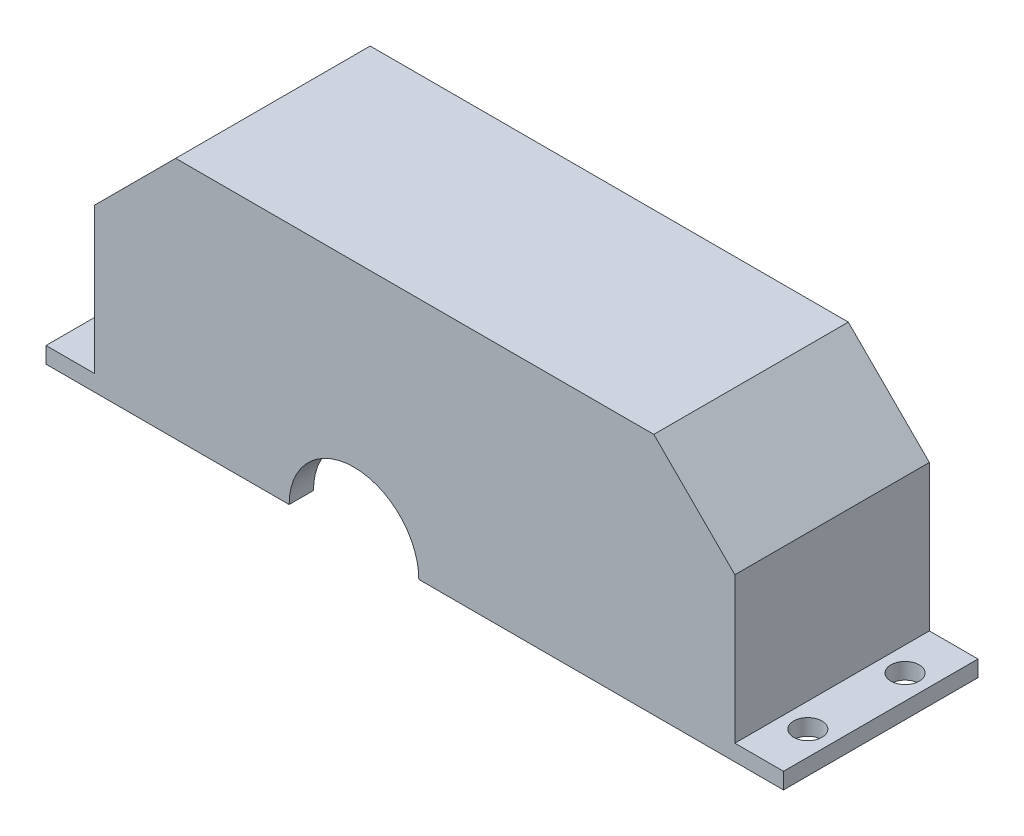
ISO-10303-21;
HEADER;
FILE_DESCRIPTION(('STEP AP214'),'2;1');
FILE_NAME('part.step','',(''),(''),'','','');
FILE_SCHEMA(('AUTOMOTIVE_DESIGN { 1 0 10303 214 1 1 1 1 }'));
ENDSEC;
DATA;
#1=APPLICATION_CONTEXT('core data for automotive mechanical design processes');
#2=APPLICATION_PROTOCOL_DEFINITION('international standard','automotive_design',2000,#1);
#3=PRODUCT_CONTEXT('',#1,'mechanical');
#4=PRODUCT('Part','Part','',(#3));
#5=PRODUCT_RELATED_PRODUCT_CATEGORY('part','',(#4));
#6=PRODUCT_DEFINITION_FORMATION('','',#4);
#7=PRODUCT_DEFINITION_CONTEXT('part definition',#1,'design');
#8=PRODUCT_DEFINITION('design','',#6,#7);
#9=PRODUCT_DEFINITION_SHAPE('','',#8);
#10=(LENGTH_UNIT() NAMED_UNIT(*) SI_UNIT(.MILLI.,.METRE.));
#11=(NAMED_UNIT(*) PLANE_ANGLE_UNIT() SI_UNIT($,.RADIAN.));
#12=(NAMED_UNIT(*) SI_UNIT($,.STERADIAN.) SOLID_ANGLE_UNIT());
#13=UNCERTAINTY_MEASURE_WITH_UNIT(LENGTH_MEASURE(1.E-05),#10,'distance_accuracy_value','');
#14=(GEOMETRIC_REPRESENTATION_CONTEXT(3) GLOBAL_UNCERTAINTY_ASSIGNED_CONTEXT((#13)) GLOBAL_UNIT_ASSIGNED_CONTEXT((#10,
#11,#12)) REPRESENTATION_CONTEXT('',''));
#15=CARTESIAN_POINT('',(0.,0.,0.));
#16=DIRECTION('',(0.,0.,1.));
#17=DIRECTION('',(1.,0.,0.));
#18=AXIS2_PLACEMENT_3D('',#15,#16,#17);
#19=CARTESIAN_POINT('',(0.,0.,5.));
#20=DIRECTION('',(1.,0.,0.));
#21=DIRECTION('',(0.,1.,0.));
#22=AXIS2_PLACEMENT_3D('',#19,#20,#21);
#23=PLANE('',#22);
#24=DIRECTION('',(0.,-1.,0.));
#25=VECTOR('',#24,1.);
#26=CARTESIAN_POINT('',(0.,0.,23.));
#27=LINE('',#26,#25);
#28=CARTESIAN_POINT('',(0.,20.,23.));
#29=VERTEX_POINT('',#28);
#30=CARTESIAN_POINT('',(0.,2.,23.));
#31=VERTEX_POINT('',#30);
#32=EDGE_CURVE('E333',#29,#31,#27,.T.);
#33=ORIENTED_EDGE('',*,*,#32,.F.);
#34=DIRECTION('',(0.,0.,-1.));
#35=VECTOR('',#34,1.);
#36=CARTESIAN_POINT('',(0.,20.,5.));
#37=LINE('',#36,#35);
#38=CARTESIAN_POINT('',(0.,20.,-1.));
#39=VERTEX_POINT('',#38);
#40=EDGE_CURVE('E427',#29,#39,#37,.T.);
#41=ORIENTED_EDGE('',*,*,#40,.T.);
#42=DIRECTION('',(0.,1.,0.));
#43=VECTOR('',#42,1.);
#44=CARTESIAN_POINT('',(0.,30.,-1.));
#45=LINE('',#44,#43);
#46=CARTESIAN_POINT('',(0.,2.,-1.));
#47=VERTEX_POINT('',#46);
#48=EDGE_CURVE('E237',#47,#39,#45,.T.);
#49=ORIENTED_EDGE('',*,*,#48,.F.);
#50=DIRECTION('',(0.,0.,-1.));
#51=VECTOR('',#50,1.);
#52=CARTESIAN_POINT('',(0.,2.,-1.));
#53=LINE('',#52,#51);
#54=EDGE_CURVE('E253',#31,#47,#53,.T.);
#55=ORIENTED_EDGE('',*,*,#54,.F.);
#56=EDGE_LOOP('',(#33,#41,#49,#55));
#57=FACE_BOUND('',#56,.T.);
#58=ADVANCED_FACE('F40',(#57),#23,.F.);
#59=CARTESIAN_POINT('',(32.,0.,5.));
#60=DIRECTION('',(0.,0.,-1.));
#61=DIRECTION('',(-1.,0.,0.));
#62=AXIS2_PLACEMENT_3D('',#59,#60,#61);
#63=CYLINDRICAL_SURFACE('',#62,8.00000000000001);
#64=CARTESIAN_POINT('',(32.,0.,0.));
#65=DIRECTION('',(0.,0.,1.));
#66=DIRECTION('',(1.,0.,0.));
#67=AXIS2_PLACEMENT_3D('',#64,#65,#66);
#68=CIRCLE('',#67,8.00000000000001);
#69=CARTESIAN_POINT('',(40.,0.,0.));
#70=VERTEX_POINT('',#69);
#71=CARTESIAN_POINT('',(24.,0.,0.));
#72=VERTEX_POINT('',#71);
#73=EDGE_CURVE('E368',#70,#72,#68,.T.);
#74=ORIENTED_EDGE('',*,*,#73,.F.);
#75=DIRECTION('',(0.,0.,-1.));
#76=VECTOR('',#75,1.);
#77=CARTESIAN_POINT('',(40.,0.,5.));
#78=LINE('',#77,#76);
#79=CARTESIAN_POINT('',(40.,0.,5.));
#80=VERTEX_POINT('',#79);
#81=EDGE_CURVE('E396',#80,#70,#78,.T.);
#82=ORIENTED_EDGE('',*,*,#81,.F.);
#83=CARTESIAN_POINT('',(32.,0.,5.));
#84=DIRECTION('',(0.,0.,1.));
#85=DIRECTION('',(1.,0.,0.));
#86=AXIS2_PLACEMENT_3D('',#83,#84,#85);
#87=CIRCLE('',#86,8.00000000000001);
#88=CARTESIAN_POINT('',(24.,0.,5.));
#89=VERTEX_POINT('',#88);
#90=EDGE_CURVE('E369',#80,#89,#87,.T.);
#91=ORIENTED_EDGE('',*,*,#90,.T.);
#92=DIRECTION('',(0.,0.,-1.));
#93=VECTOR('',#92,1.);
#94=CARTESIAN_POINT('',(24.,0.,5.));
#95=LINE('',#94,#93);
#96=EDGE_CURVE('E387',#89,#72,#95,.T.);
#97=ORIENTED_EDGE('',*,*,#96,.T.);
#98=EDGE_LOOP('',(#74,#82,#91,#97));
#99=FACE_BOUND('',#98,.T.);
#100=ADVANCED_FACE('F501',(#99),#63,.F.);
#101=CARTESIAN_POINT('',(0.,0.,5.));
#102=DIRECTION('',(0.,1.,0.));
#103=DIRECTION('',(-1.,0.,0.));
#104=AXIS2_PLACEMENT_3D('',#101,#102,#103);
#105=PLANE('',#104);
#106=ORIENTED_EDGE('',*,*,#81,.T.);
#107=DIRECTION('',(-1.,0.,0.));
#108=VECTOR('',#107,1.);
#109=CARTESIAN_POINT('',(40.,0.,0.));
#110=LINE('',#109,#108);
#111=CARTESIAN_POINT('',(38.,0.,0.));
#112=VERTEX_POINT('',#111);
#113=EDGE_CURVE('E288',#70,#112,#110,.T.);
#114=ORIENTED_EDGE('',*,*,#113,.T.);
#115=DIRECTION('',(0.,0.,1.));
#116=VECTOR('',#115,1.);
#117=CARTESIAN_POINT('',(38.,0.,-1.));
#118=LINE('',#117,#116);
#119=CARTESIAN_POINT('',(38.,0.,-1.));
#120=VERTEX_POINT('',#119);
#121=EDGE_CURVE('E317',#120,#112,#118,.T.);
#122=ORIENTED_EDGE('',*,*,#121,.F.);
#123=DIRECTION('',(-1.,0.,0.));
#124=VECTOR('',#123,1.);
#125=CARTESIAN_POINT('',(46.,0.,-1.));
#126=LINE('',#125,#124);
#127=CARTESIAN_POINT('',(46.,0.,-1.));
#128=VERTEX_POINT('',#127);
#129=EDGE_CURVE('E306',#128,#120,#126,.T.);
#130=ORIENTED_EDGE('',*,*,#129,.F.);
#131=DIRECTION('',(0.,0.,-1.));
#132=VECTOR('',#131,1.);
#133=CARTESIAN_POINT('',(46.,0.,5.));
#134=LINE('',#133,#132);
#135=CARTESIAN_POINT('',(46.,0.,5.));
#136=VERTEX_POINT('',#135);
#137=EDGE_CURVE('E393',#136,#128,#134,.T.);
#138=ORIENTED_EDGE('',*,*,#137,.F.);
#139=DIRECTION('',(1.,0.,0.));
#140=VECTOR('',#139,1.);
#141=CARTESIAN_POINT('',(0.,0.,5.));
#142=LINE('',#141,#140);
#143=EDGE_CURVE('E372',#80,#136,#142,.T.);
#144=ORIENTED_EDGE('',*,*,#143,.F.);
#145=EDGE_LOOP('',(#106,#114,#122,#130,#138,#144));
#146=FACE_BOUND('',#145,.T.);
#147=ADVANCED_FACE('F504',(#146),#105,.F.);
#148=CARTESIAN_POINT('',(46.,0.,5.));
#149=DIRECTION('',(1.,0.,0.));
#150=DIRECTION('',(0.,1.,0.));
#151=AXIS2_PLACEMENT_3D('',#148,#149,#150);
#152=PLANE('',#151);
#153=DIRECTION('',(0.,-1.,0.));
#154=VECTOR('',#153,1.);
#155=CARTESIAN_POINT('',(46.,12.,-1.));
#156=LINE('',#155,#154);
#157=CARTESIAN_POINT('',(46.,9.,-1.));
#158=VERTEX_POINT('',#157);
#159=EDGE_CURVE('E304',#158,#128,#156,.T.);
#160=ORIENTED_EDGE('',*,*,#159,.F.);
#161=DIRECTION('',(0.,0.,-1.));
#162=VECTOR('',#161,1.);
#163=CARTESIAN_POINT('',(46.,9.,5.));
#164=LINE('',#163,#162);
#165=CARTESIAN_POINT('',(46.,9.,5.));
#166=VERTEX_POINT('',#165);
#167=EDGE_CURVE('E450',#158,#166,#164,.F.);
#168=ORIENTED_EDGE('',*,*,#167,.T.);
#169=DIRECTION('',(0.,-1.,0.));
#170=VECTOR('',#169,1.);
#171=CARTESIAN_POINT('',(46.,0.,5.));
#172=LINE('',#171,#170);
#173=EDGE_CURVE('E375',#166,#136,#172,.T.);
#174=ORIENTED_EDGE('',*,*,#173,.T.);
#175=ORIENTED_EDGE('',*,*,#137,.T.);
#176=EDGE_LOOP('',(#160,#168,#174,#175));
#177=FACE_BOUND('',#176,.T.);
#178=ADVANCED_FACE('F509',(#177),#152,.T.);
#179=CARTESIAN_POINT('',(0.,12.,5.));
#180=DIRECTION('',(0.,-1.,0.));
#181=DIRECTION('',(1.,0.,0.));
#182=AXIS2_PLACEMENT_3D('',#179,#180,#181);
#183=PLANE('',#182);
#184=DIRECTION('',(-1.,0.,0.));
#185=VECTOR('',#184,1.);
#186=CARTESIAN_POINT('',(0.,12.,5.));
#187=LINE('',#186,#185);
#188=CARTESIAN_POINT('',(70.,12.,5.));
#189=VERTEX_POINT('',#188);
#190=CARTESIAN_POINT('',(49.,12.,5.));
#191=VERTEX_POINT('',#190);
#192=EDGE_CURVE('E377',#189,#191,#187,.T.);
#193=ORIENTED_EDGE('',*,*,#192,.T.);
#194=DIRECTION('',(0.,0.,-1.));
#195=VECTOR('',#194,1.);
#196=CARTESIAN_POINT('',(49.,12.,-1.));
#197=LINE('',#196,#195);
#198=CARTESIAN_POINT('',(49.,12.,-1.));
#199=VERTEX_POINT('',#198);
#200=EDGE_CURVE('E447',#191,#199,#197,.T.);
#201=ORIENTED_EDGE('',*,*,#200,.T.);
#202=DIRECTION('',(-1.,0.,0.));
#203=VECTOR('',#202,1.);
#204=CARTESIAN_POINT('',(73.,12.,-1.));
#205=LINE('',#204,#203);
#206=CARTESIAN_POINT('',(70.,12.,-1.));
#207=VERTEX_POINT('',#206);
#208=EDGE_CURVE('E301',#207,#199,#205,.T.);
#209=ORIENTED_EDGE('',*,*,#208,.F.);
#210=DIRECTION('',(0.,0.,-1.));
#211=VECTOR('',#210,1.);
#212=CARTESIAN_POINT('',(70.,12.,5.));
#213=LINE('',#212,#211);
#214=EDGE_CURVE('E445',#207,#189,#213,.F.);
#215=ORIENTED_EDGE('',*,*,#214,.T.);
#216=EDGE_LOOP('',(#193,#201,#209,#215));
#217=FACE_BOUND('',#216,.T.);
#218=ADVANCED_FACE('F460',(#217),#183,.T.);
#219=CARTESIAN_POINT('',(73.,0.,5.));
#220=DIRECTION('',(-1.,0.,0.));
#221=DIRECTION('',(0.,0.,1.));
#222=AXIS2_PLACEMENT_3D('',#219,#220,#221);
#223=PLANE('',#222);
#224=DIRECTION('',(0.,1.,0.));
#225=VECTOR('',#224,1.);
#226=CARTESIAN_POINT('',(73.,0.,5.));
#227=LINE('',#226,#225);
#228=CARTESIAN_POINT('',(73.,0.,5.));
#229=VERTEX_POINT('',#228);
#230=CARTESIAN_POINT('',(73.,9.,5.));
#231=VERTEX_POINT('',#230);
#232=EDGE_CURVE('E380',#229,#231,#227,.T.);
#233=ORIENTED_EDGE('',*,*,#232,.T.);
#234=DIRECTION('',(0.,0.,-1.));
#235=VECTOR('',#234,1.);
#236=CARTESIAN_POINT('',(73.,9.,-1.));
#237=LINE('',#236,#235);
#238=CARTESIAN_POINT('',(73.,9.,-1.));
#239=VERTEX_POINT('',#238);
#240=EDGE_CURVE('E452',#231,#239,#237,.T.);
#241=ORIENTED_EDGE('',*,*,#240,.T.);
#242=DIRECTION('',(0.,1.,0.));
#243=VECTOR('',#242,1.);
#244=CARTESIAN_POINT('',(73.,0.,-1.));
#245=LINE('',#244,#243);
#246=CARTESIAN_POINT('',(73.,0.,-1.));
#247=VERTEX_POINT('',#246);
#248=EDGE_CURVE('E298',#247,#239,#245,.T.);
#249=ORIENTED_EDGE('',*,*,#248,.F.);
#250=DIRECTION('',(0.,0.,-1.));
#251=VECTOR('',#250,1.);
#252=CARTESIAN_POINT('',(73.,0.,5.));
#253=LINE('',#252,#251);
#254=EDGE_CURVE('E391',#229,#247,#253,.T.);
#255=ORIENTED_EDGE('',*,*,#254,.F.);
#256=EDGE_LOOP('',(#233,#241,#249,#255));
#257=FACE_BOUND('',#256,.T.);
#258=ADVANCED_FACE('F463',(#257),#223,.T.);
#259=CARTESIAN_POINT('',(0.,1.03004910467482E-13,5.));
#260=DIRECTION('',(0.,1.,0.));
#261=DIRECTION('',(-1.,0.,0.));
#262=AXIS2_PLACEMENT_3D('',#259,#260,#261);
#263=PLANE('',#262);
#264=CARTESIAN_POINT('',(82.,0.,4.99999999999999));
#265=DIRECTION('',(0.,1.,0.));
#266=DIRECTION('',(0.,0.,-1.));
#267=AXIS2_PLACEMENT_3D('',#264,#265,#266);
#268=CIRCLE('',#267,1.74999999999997);
#269=CARTESIAN_POINT('',(82.,0.,3.25000000000002));
#270=VERTEX_POINT('',#269);
#271=EDGE_CURVE('E1014',#270,#270,#268,.T.);
#272=ORIENTED_EDGE('',*,*,#271,.T.);
#273=EDGE_LOOP('',(#272));
#274=FACE_BOUND('',#273,.T.);
#275=CARTESIAN_POINT('',(82.,0.,17.));
#276=DIRECTION('',(0.,1.,0.));
#277=DIRECTION('',(0.,0.,-1.));
#278=AXIS2_PLACEMENT_3D('',#275,#276,#277);
#279=CIRCLE('',#278,1.74999999999997);
#280=CARTESIAN_POINT('',(82.,0.,15.25));
#281=VERTEX_POINT('',#280);
#282=EDGE_CURVE('E1011',#281,#281,#279,.T.);
#283=ORIENTED_EDGE('',*,*,#282,.T.);
#284=EDGE_LOOP('',(#283));
#285=FACE_BOUND('',#284,.T.);
#286=ORIENTED_EDGE('',*,*,#254,.T.);
#287=DIRECTION('',(-1.,0.,0.));
#288=VECTOR('',#287,1.);
#289=CARTESIAN_POINT('',(79.,0.,-1.));
#290=LINE('',#289,#288);
#291=CARTESIAN_POINT('',(85.,0.,-1.));
#292=VERTEX_POINT('',#291);
#293=EDGE_CURVE('E295',#292,#247,#290,.T.);
#294=ORIENTED_EDGE('',*,*,#293,.F.);
#295=DIRECTION('',(0.,0.,-1.));
#296=VECTOR('',#295,1.);
#297=CARTESIAN_POINT('',(85.,0.,23.));
#298=LINE('',#297,#296);
#299=CARTESIAN_POINT('',(85.,0.,23.));
#300=VERTEX_POINT('',#299);
#301=EDGE_CURVE('E273',#300,#292,#298,.T.);
#302=ORIENTED_EDGE('',*,*,#301,.F.);
#303=DIRECTION('',(1.,0.,0.));
#304=VECTOR('',#303,1.);
#305=CARTESIAN_POINT('',(79.,0.,23.));
#306=LINE('',#305,#304);
#307=CARTESIAN_POINT('',(40.,0.,23.));
#308=VERTEX_POINT('',#307);
#309=EDGE_CURVE('E325',#308,#300,#306,.T.);
#310=ORIENTED_EDGE('',*,*,#309,.F.);
#311=DIRECTION('',(0.,0.,-1.));
#312=VECTOR('',#311,1.);
#313=CARTESIAN_POINT('',(40.,0.,23.));
#314=LINE('',#313,#312);
#315=CARTESIAN_POINT('',(40.,0.,20.));
#316=VERTEX_POINT('',#315);
#317=EDGE_CURVE('E335',#308,#316,#314,.T.);
#318=ORIENTED_EDGE('',*,*,#317,.T.);
#319=DIRECTION('',(1.,0.,0.));
#320=VECTOR('',#319,1.);
#321=CARTESIAN_POINT('',(79.,0.,20.));
#322=LINE('',#321,#320);
#323=CARTESIAN_POINT('',(76.,0.,20.));
#324=VERTEX_POINT('',#323);
#325=EDGE_CURVE('E323',#316,#324,#322,.T.);
#326=ORIENTED_EDGE('',*,*,#325,.T.);
#327=DIRECTION('',(0.,0.,-1.));
#328=VECTOR('',#327,1.);
#329=CARTESIAN_POINT('',(76.,0.,20.));
#330=LINE('',#329,#328);
#331=CARTESIAN_POINT('',(76.,0.,5.));
#332=VERTEX_POINT('',#331);
#333=EDGE_CURVE('E365',#324,#332,#330,.T.);
#334=ORIENTED_EDGE('',*,*,#333,.T.);
#335=DIRECTION('',(1.,0.,0.));
#336=VECTOR('',#335,1.);
#337=CARTESIAN_POINT('',(0.,1.03004910467482E-13,5.));
#338=LINE('',#337,#336);
#339=EDGE_CURVE('E382',#229,#332,#338,.T.);
#340=ORIENTED_EDGE('',*,*,#339,.F.);
#341=EDGE_LOOP('',(#286,#294,#302,#310,#318,#326,#334,#340));
#342=FACE_BOUND('',#341,.T.);
#343=ADVANCED_FACE('F470',(#274,#285,#342),#263,.F.);
#344=CARTESIAN_POINT('',(79.,0.,5.));
#345=DIRECTION('',(1.,0.,0.));
#346=DIRECTION('',(0.,0.,-1.));
#347=AXIS2_PLACEMENT_3D('',#344,#345,#346);
#348=PLANE('',#347);
#349=DIRECTION('',(0.,-1.,0.));
#350=VECTOR('',#349,1.);
#351=CARTESIAN_POINT('',(79.,30.,-1.));
#352=LINE('',#351,#350);
#353=CARTESIAN_POINT('',(79.,20.,-1.));
#354=VERTEX_POINT('',#353);
#355=CARTESIAN_POINT('',(79.,2.,-1.));
#356=VERTEX_POINT('',#355);
#357=EDGE_CURVE('E292',#354,#356,#352,.T.);
#358=ORIENTED_EDGE('',*,*,#357,.F.);
#359=DIRECTION('',(0.,0.,1.));
#360=VECTOR('',#359,1.);
#361=CARTESIAN_POINT('',(79.,20.,23.));
#362=LINE('',#361,#360);
#363=CARTESIAN_POINT('',(79.,20.,23.));
#364=VERTEX_POINT('',#363);
#365=EDGE_CURVE('E443',#354,#364,#362,.T.);
#366=ORIENTED_EDGE('',*,*,#365,.T.);
#367=DIRECTION('',(0.,1.,0.));
#368=VECTOR('',#367,1.);
#369=CARTESIAN_POINT('',(79.,30.,23.));
#370=LINE('',#369,#368);
#371=CARTESIAN_POINT('',(79.,2.00000000000001,23.));
#372=VERTEX_POINT('',#371);
#373=EDGE_CURVE('E327',#372,#364,#370,.T.);
#374=ORIENTED_EDGE('',*,*,#373,.F.);
#375=DIRECTION('',(0.,0.,1.));
#376=VECTOR('',#375,1.);
#377=CARTESIAN_POINT('',(79.,2.00000000000001,23.));
#378=LINE('',#377,#376);
#379=EDGE_CURVE('E269',#356,#372,#378,.T.);
#380=ORIENTED_EDGE('',*,*,#379,.F.);
#381=EDGE_LOOP('',(#358,#366,#374,#380));
#382=FACE_BOUND('',#381,.T.);
#383=ADVANCED_FACE('F546',(#382),#348,.T.);
#384=CARTESIAN_POINT('',(0.,30.,5.));
#385=DIRECTION('',(0.,-1.,0.));
#386=DIRECTION('',(1.,0.,0.));
#387=AXIS2_PLACEMENT_3D('',#384,#385,#386);
#388=PLANE('',#387);
#389=DIRECTION('',(1.,0.,0.));
#390=VECTOR('',#389,1.);
#391=CARTESIAN_POINT('',(79.,30.,-1.));
#392=LINE('',#391,#390);
#393=CARTESIAN_POINT('',(10.,30.,-1.));
#394=VERTEX_POINT('',#393);
#395=CARTESIAN_POINT('',(69.,30.,-1.));
#396=VERTEX_POINT('',#395);
#397=EDGE_CURVE('E289',#394,#396,#392,.T.);
#398=ORIENTED_EDGE('',*,*,#397,.F.);
#399=DIRECTION('',(0.,0.,1.));
#400=VECTOR('',#399,1.);
#401=CARTESIAN_POINT('',(10.,30.,5.));
#402=LINE('',#401,#400);
#403=CARTESIAN_POINT('',(10.,30.,23.));
#404=VERTEX_POINT('',#403);
#405=EDGE_CURVE('E437',#394,#404,#402,.T.);
#406=ORIENTED_EDGE('',*,*,#405,.T.);
#407=DIRECTION('',(-1.,0.,0.));
#408=VECTOR('',#407,1.);
#409=CARTESIAN_POINT('',(0.,30.,23.));
#410=LINE('',#409,#408);
#411=CARTESIAN_POINT('',(69.,30.,23.));
#412=VERTEX_POINT('',#411);
#413=EDGE_CURVE('E330',#412,#404,#410,.T.);
#414=ORIENTED_EDGE('',*,*,#413,.F.);
#415=DIRECTION('',(0.,0.,-1.));
#416=VECTOR('',#415,1.);
#417=CARTESIAN_POINT('',(69.,30.,-1.));
#418=LINE('',#417,#416);
#419=EDGE_CURVE('E434',#412,#396,#418,.T.);
#420=ORIENTED_EDGE('',*,*,#419,.T.);
#421=EDGE_LOOP('',(#398,#406,#414,#420));
#422=FACE_BOUND('',#421,.T.);
#423=ADVANCED_FACE('F543',(#422),#388,.F.);
#424=CARTESIAN_POINT('',(0.,0.,5.));
#425=DIRECTION('',(0.,1.,0.));
#426=DIRECTION('',(-1.,0.,0.));
#427=AXIS2_PLACEMENT_3D('',#424,#425,#426);
#428=PLANE('',#427);
#429=CARTESIAN_POINT('',(-3.,0.,17.));
#430=DIRECTION('',(0.,1.,0.));
#431=DIRECTION('',(0.,0.,1.));
#432=AXIS2_PLACEMENT_3D('',#429,#430,#431);
#433=CIRCLE('',#432,1.75);
#434=CARTESIAN_POINT('',(-3.,0.,18.75));
#435=VERTEX_POINT('',#434);
#436=EDGE_CURVE('E1008',#435,#435,#433,.T.);
#437=ORIENTED_EDGE('',*,*,#436,.T.);
#438=EDGE_LOOP('',(#437));
#439=FACE_BOUND('',#438,.T.);
#440=CARTESIAN_POINT('',(-3.,0.,5.));
#441=DIRECTION('',(0.,1.,0.));
#442=DIRECTION('',(0.,0.,1.));
#443=AXIS2_PLACEMENT_3D('',#440,#441,#442);
#444=CIRCLE('',#443,1.75);
#445=CARTESIAN_POINT('',(-3.,0.,6.75));
#446=VERTEX_POINT('',#445);
#447=EDGE_CURVE('E259',#446,#446,#444,.T.);
#448=ORIENTED_EDGE('',*,*,#447,.T.);
#449=EDGE_LOOP('',(#448));
#450=FACE_BOUND('',#449,.T.);
#451=DIRECTION('',(1.,0.,0.));
#452=VECTOR('',#451,1.);
#453=CARTESIAN_POINT('',(24.,0.,23.));
#454=LINE('',#453,#452);
#455=CARTESIAN_POINT('',(-6.,0.,23.));
#456=VERTEX_POINT('',#455);
#457=CARTESIAN_POINT('',(24.,0.,23.));
#458=VERTEX_POINT('',#457);
#459=EDGE_CURVE('E244',#456,#458,#454,.T.);
#460=ORIENTED_EDGE('',*,*,#459,.F.);
#461=DIRECTION('',(0.,0.,1.));
#462=VECTOR('',#461,1.);
#463=CARTESIAN_POINT('',(-6.,0.,-1.));
#464=LINE('',#463,#462);
#465=CARTESIAN_POINT('',(-6.,0.,-1.));
#466=VERTEX_POINT('',#465);
#467=EDGE_CURVE('E240',#466,#456,#464,.T.);
#468=ORIENTED_EDGE('',*,*,#467,.F.);
#469=DIRECTION('',(-1.,0.,0.));
#470=VECTOR('',#469,1.);
#471=CARTESIAN_POINT('',(0.,0.,-1.));
#472=LINE('',#471,#470);
#473=CARTESIAN_POINT('',(26.,0.,-1.));
#474=VERTEX_POINT('',#473);
#475=EDGE_CURVE('E225',#474,#466,#472,.T.);
#476=ORIENTED_EDGE('',*,*,#475,.F.);
#477=DIRECTION('',(0.,0.,1.));
#478=VECTOR('',#477,1.);
#479=CARTESIAN_POINT('',(26.,0.,-1.));
#480=LINE('',#479,#478);
#481=CARTESIAN_POINT('',(26.,0.,0.));
#482=VERTEX_POINT('',#481);
#483=EDGE_CURVE('E310',#474,#482,#480,.T.);
#484=ORIENTED_EDGE('',*,*,#483,.T.);
#485=DIRECTION('',(-1.,0.,0.));
#486=VECTOR('',#485,1.);
#487=CARTESIAN_POINT('',(0.,0.,0.));
#488=LINE('',#487,#486);
#489=EDGE_CURVE('E293',#482,#72,#488,.T.);
#490=ORIENTED_EDGE('',*,*,#489,.T.);
#491=ORIENTED_EDGE('',*,*,#96,.F.);
#492=DIRECTION('',(1.,0.,0.));
#493=VECTOR('',#492,1.);
#494=CARTESIAN_POINT('',(0.,0.,5.));
#495=LINE('',#494,#493);
#496=CARTESIAN_POINT('',(3.,0.,5.));
#497=VERTEX_POINT('',#496);
#498=EDGE_CURVE('E385',#497,#89,#495,.T.);
#499=ORIENTED_EDGE('',*,*,#498,.F.);
#500=DIRECTION('',(0.,0.,-1.));
#501=VECTOR('',#500,1.);
#502=CARTESIAN_POINT('',(3.,0.,20.));
#503=LINE('',#502,#501);
#504=CARTESIAN_POINT('',(3.,0.,20.));
#505=VERTEX_POINT('',#504);
#506=EDGE_CURVE('E356',#505,#497,#503,.T.);
#507=ORIENTED_EDGE('',*,*,#506,.F.);
#508=DIRECTION('',(1.,0.,0.));
#509=VECTOR('',#508,1.);
#510=CARTESIAN_POINT('',(24.,0.,20.));
#511=LINE('',#510,#509);
#512=CARTESIAN_POINT('',(24.,0.,20.));
#513=VERTEX_POINT('',#512);
#514=EDGE_CURVE('E320',#505,#513,#511,.T.);
#515=ORIENTED_EDGE('',*,*,#514,.T.);
#516=DIRECTION('',(0.,0.,-1.));
#517=VECTOR('',#516,1.);
#518=CARTESIAN_POINT('',(24.,0.,23.));
#519=LINE('',#518,#517);
#520=EDGE_CURVE('E343',#458,#513,#519,.T.);
#521=ORIENTED_EDGE('',*,*,#520,.F.);
#522=EDGE_LOOP('',(#460,#468,#476,#484,#490,#491,#499,#507,#515,#521));
#523=FACE_BOUND('',#522,.T.);
#524=ADVANCED_FACE('F241',(#439,#450,#523),#428,.F.);
#525=CARTESIAN_POINT('',(0.,0.,5.));
#526=DIRECTION('',(0.,0.,1.));
#527=DIRECTION('',(1.,0.,0.));
#528=AXIS2_PLACEMENT_3D('',#525,#526,#527);
#529=PLANE('',#528);
#530=DIRECTION('',(1.,0.,0.));
#531=VECTOR('',#530,1.);
#532=CARTESIAN_POINT('',(76.,27.,5.));
#533=LINE('',#532,#531);
#534=CARTESIAN_POINT('',(10.,27.,5.));
#535=VERTEX_POINT('',#534);
#536=CARTESIAN_POINT('',(69.,27.,5.));
#537=VERTEX_POINT('',#536);
#538=EDGE_CURVE('E359',#535,#537,#533,.T.);
#539=ORIENTED_EDGE('',*,*,#538,.F.);
#540=DIRECTION('',(0.707106781186552,0.707106781186543,0.));
#541=VECTOR('',#540,1.);
#542=CARTESIAN_POINT('',(-8.50000000000004,8.50000000000015,5.));
#543=LINE('',#542,#541);
#544=CARTESIAN_POINT('',(3.,20.,5.));
#545=VERTEX_POINT('',#544);
#546=EDGE_CURVE('E416',#535,#545,#543,.F.);
#547=ORIENTED_EDGE('',*,*,#546,.T.);
#548=DIRECTION('',(0.,1.,0.));
#549=VECTOR('',#548,1.);
#550=CARTESIAN_POINT('',(3.,27.,5.));
#551=LINE('',#550,#549);
#552=EDGE_CURVE('E346',#497,#545,#551,.T.);
#553=ORIENTED_EDGE('',*,*,#552,.F.);
#554=ORIENTED_EDGE('',*,*,#498,.T.);
#555=ORIENTED_EDGE('',*,*,#90,.F.);
#556=ORIENTED_EDGE('',*,*,#143,.T.);
#557=ORIENTED_EDGE('',*,*,#173,.F.);
#558=CARTESIAN_POINT('',(49.,9.,5.));
#559=DIRECTION('',(0.,0.,1.));
#560=DIRECTION('',(1.,0.,0.));
#561=AXIS2_PLACEMENT_3D('',#558,#559,#560);
#562=CIRCLE('',#561,3.);
#563=EDGE_CURVE('E456',#166,#191,#562,.F.);
#564=ORIENTED_EDGE('',*,*,#563,.T.);
#565=ORIENTED_EDGE('',*,*,#192,.F.);
#566=CARTESIAN_POINT('',(70.,9.,5.));
#567=DIRECTION('',(0.,0.,1.));
#568=DIRECTION('',(1.,0.,0.));
#569=AXIS2_PLACEMENT_3D('',#566,#567,#568);
#570=CIRCLE('',#569,3.);
#571=EDGE_CURVE('E11',#189,#231,#570,.F.);
#572=ORIENTED_EDGE('',*,*,#571,.T.);
#573=ORIENTED_EDGE('',*,*,#232,.F.);
#574=ORIENTED_EDGE('',*,*,#339,.T.);
#575=DIRECTION('',(0.,-1.,0.));
#576=VECTOR('',#575,1.);
#577=CARTESIAN_POINT('',(76.,0.,5.));
#578=LINE('',#577,#576);
#579=CARTESIAN_POINT('',(76.,20.,5.));
#580=VERTEX_POINT('',#579);
#581=EDGE_CURVE('E351',#580,#332,#578,.T.);
#582=ORIENTED_EDGE('',*,*,#581,.F.);
#583=DIRECTION('',(0.707106781186544,-0.707106781186551,0.));
#584=VECTOR('',#583,1.);
#585=CARTESIAN_POINT('',(48.0000000000004,47.9999999999999,5.));
#586=LINE('',#585,#584);
#587=EDGE_CURVE('E414',#580,#537,#586,.F.);
#588=ORIENTED_EDGE('',*,*,#587,.T.);
#589=EDGE_LOOP('',(#539,#547,#553,#554,#555,#556,#557,#564,#565,#572,#573,#574,#582,#588));
#590=FACE_BOUND('',#589,.T.);
#591=ADVANCED_FACE('F466',(#590),#529,.T.);
#592=CARTESIAN_POINT('',(3.,27.,20.));
#593=DIRECTION('',(-1.,0.,0.));
#594=DIRECTION('',(0.,-1.,0.));
#595=AXIS2_PLACEMENT_3D('',#592,#593,#594);
#596=PLANE('',#595);
#597=ORIENTED_EDGE('',*,*,#552,.T.);
#598=DIRECTION('',(0.,0.,1.));
#599=VECTOR('',#598,1.);
#600=CARTESIAN_POINT('',(3.,20.,20.));
#601=LINE('',#600,#599);
#602=CARTESIAN_POINT('',(3.,20.,20.));
#603=VERTEX_POINT('',#602);
#604=EDGE_CURVE('E418',#545,#603,#601,.T.);
#605=ORIENTED_EDGE('',*,*,#604,.T.);
#606=DIRECTION('',(0.,1.,0.));
#607=VECTOR('',#606,1.);
#608=CARTESIAN_POINT('',(3.,27.,20.));
#609=LINE('',#608,#607);
#610=EDGE_CURVE('E347',#505,#603,#609,.T.);
#611=ORIENTED_EDGE('',*,*,#610,.F.);
#612=ORIENTED_EDGE('',*,*,#506,.T.);
#613=EDGE_LOOP('',(#597,#605,#611,#612));
#614=FACE_BOUND('',#613,.T.);
#615=ADVANCED_FACE('F490',(#614),#596,.F.);
#616=CARTESIAN_POINT('',(76.,27.,20.));
#617=DIRECTION('',(0.,1.,0.));
#618=DIRECTION('',(-1.,0.,0.));
#619=AXIS2_PLACEMENT_3D('',#616,#617,#618);
#620=PLANE('',#619);
#621=DIRECTION('',(1.,0.,0.));
#622=VECTOR('',#621,1.);
#623=CARTESIAN_POINT('',(76.,27.,20.));
#624=LINE('',#623,#622);
#625=CARTESIAN_POINT('',(10.,27.,20.));
#626=VERTEX_POINT('',#625);
#627=CARTESIAN_POINT('',(69.,27.,20.));
#628=VERTEX_POINT('',#627);
#629=EDGE_CURVE('E350',#626,#628,#624,.T.);
#630=ORIENTED_EDGE('',*,*,#629,.F.);
#631=DIRECTION('',(0.,0.,-1.));
#632=VECTOR('',#631,1.);
#633=CARTESIAN_POINT('',(10.,27.,5.));
#634=LINE('',#633,#632);
#635=EDGE_CURVE('E411',#626,#535,#634,.T.);
#636=ORIENTED_EDGE('',*,*,#635,.T.);
#637=ORIENTED_EDGE('',*,*,#538,.T.);
#638=DIRECTION('',(0.,0.,1.));
#639=VECTOR('',#638,1.);
#640=CARTESIAN_POINT('',(69.,27.,20.));
#641=LINE('',#640,#639);
#642=EDGE_CURVE('E398',#537,#628,#641,.T.);
#643=ORIENTED_EDGE('',*,*,#642,.T.);
#644=EDGE_LOOP('',(#630,#636,#637,#643));
#645=FACE_BOUND('',#644,.T.);
#646=ADVANCED_FACE('F482',(#645),#620,.F.);
#647=CARTESIAN_POINT('',(76.,0.,20.));
#648=DIRECTION('',(1.,0.,0.));
#649=DIRECTION('',(0.,0.,-1.));
#650=AXIS2_PLACEMENT_3D('',#647,#648,#649);
#651=PLANE('',#650);
#652=DIRECTION('',(0.,-1.,0.));
#653=VECTOR('',#652,1.);
#654=CARTESIAN_POINT('',(76.,0.,20.));
#655=LINE('',#654,#653);
#656=CARTESIAN_POINT('',(76.,20.,20.));
#657=VERTEX_POINT('',#656);
#658=EDGE_CURVE('E354',#657,#324,#655,.T.);
#659=ORIENTED_EDGE('',*,*,#658,.F.);
#660=DIRECTION('',(0.,0.,-1.));
#661=VECTOR('',#660,1.);
#662=CARTESIAN_POINT('',(76.,20.,5.));
#663=LINE('',#662,#661);
#664=EDGE_CURVE('E424',#657,#580,#663,.T.);
#665=ORIENTED_EDGE('',*,*,#664,.T.);
#666=ORIENTED_EDGE('',*,*,#581,.T.);
#667=ORIENTED_EDGE('',*,*,#333,.F.);
#668=EDGE_LOOP('',(#659,#665,#666,#667));
#669=FACE_BOUND('',#668,.T.);
#670=ADVANCED_FACE('F474',(#669),#651,.F.);
#671=CARTESIAN_POINT('',(32.,0.,20.));
#672=DIRECTION('',(0.,0.,1.));
#673=DIRECTION('',(1.,0.,0.));
#674=AXIS2_PLACEMENT_3D('',#671,#672,#673);
#675=PLANE('',#674);
#676=ORIENTED_EDGE('',*,*,#610,.T.);
#677=DIRECTION('',(-0.707106781186552,-0.707106781186543,0.));
#678=VECTOR('',#677,1.);
#679=CARTESIAN_POINT('',(10.,27.,20.));
#680=LINE('',#679,#678);
#681=EDGE_CURVE('E422',#603,#626,#680,.F.);
#682=ORIENTED_EDGE('',*,*,#681,.T.);
#683=ORIENTED_EDGE('',*,*,#629,.T.);
#684=DIRECTION('',(-0.707106781186544,0.707106781186551,0.));
#685=VECTOR('',#684,1.);
#686=CARTESIAN_POINT('',(76.,20.,20.));
#687=LINE('',#686,#685);
#688=EDGE_CURVE('E420',#628,#657,#687,.F.);
#689=ORIENTED_EDGE('',*,*,#688,.T.);
#690=ORIENTED_EDGE('',*,*,#658,.T.);
#691=ORIENTED_EDGE('',*,*,#325,.F.);
#692=CARTESIAN_POINT('',(32.,0.,20.));
#693=DIRECTION('',(0.,0.,-1.));
#694=DIRECTION('',(1.,0.,0.));
#695=AXIS2_PLACEMENT_3D('',#692,#693,#694);
#696=CIRCLE('',#695,8.00000000000001);
#697=EDGE_CURVE('E337',#513,#316,#696,.T.);
#698=ORIENTED_EDGE('',*,*,#697,.F.);
#699=ORIENTED_EDGE('',*,*,#514,.F.);
#700=EDGE_LOOP('',(#676,#682,#683,#689,#690,#691,#698,#699));
#701=FACE_BOUND('',#700,.T.);
#702=ADVANCED_FACE('F708',(#701),#675,.F.);
#703=CARTESIAN_POINT('',(32.,0.,23.));
#704=DIRECTION('',(0.,0.,-1.));
#705=DIRECTION('',(-1.,0.,0.));
#706=AXIS2_PLACEMENT_3D('',#703,#704,#705);
#707=CYLINDRICAL_SURFACE('',#706,8.00000000000001);
#708=ORIENTED_EDGE('',*,*,#697,.T.);
#709=ORIENTED_EDGE('',*,*,#317,.F.);
#710=CARTESIAN_POINT('',(32.,0.,23.));
#711=DIRECTION('',(0.,0.,-1.));
#712=DIRECTION('',(1.,0.,0.));
#713=AXIS2_PLACEMENT_3D('',#710,#711,#712);
#714=CIRCLE('',#713,8.00000000000001);
#715=EDGE_CURVE('E322',#458,#308,#714,.T.);
#716=ORIENTED_EDGE('',*,*,#715,.F.);
#717=ORIENTED_EDGE('',*,*,#520,.T.);
#718=EDGE_LOOP('',(#708,#709,#716,#717));
#719=FACE_BOUND('',#718,.T.);
#720=ADVANCED_FACE('F528',(#719),#707,.F.);
#721=CARTESIAN_POINT('',(32.,0.,23.));
#722=DIRECTION('',(0.,0.,1.));
#723=DIRECTION('',(1.,0.,0.));
#724=AXIS2_PLACEMENT_3D('',#721,#722,#723);
#725=PLANE('',#724);
#726=ORIENTED_EDGE('',*,*,#413,.T.);
#727=DIRECTION('',(0.707106781186549,0.707106781186547,0.));
#728=VECTOR('',#727,1.);
#729=CARTESIAN_POINT('',(6.00000000000005,26.,23.));
#730=LINE('',#729,#728);
#731=EDGE_CURVE('E441',#404,#29,#730,.F.);
#732=ORIENTED_EDGE('',*,*,#731,.T.);
#733=ORIENTED_EDGE('',*,*,#32,.T.);
#734=DIRECTION('',(1.,0.,0.));
#735=VECTOR('',#734,1.);
#736=CARTESIAN_POINT('',(-6.,2.,23.));
#737=LINE('',#736,#735);
#738=CARTESIAN_POINT('',(-6.,2.,23.));
#739=VERTEX_POINT('',#738);
#740=EDGE_CURVE('E266',#739,#31,#737,.T.);
#741=ORIENTED_EDGE('',*,*,#740,.F.);
#742=DIRECTION('',(0.,1.,0.));
#743=VECTOR('',#742,1.);
#744=CARTESIAN_POINT('',(-6.,0.,23.));
#745=LINE('',#744,#743);
#746=EDGE_CURVE('E247',#456,#739,#745,.T.);
#747=ORIENTED_EDGE('',*,*,#746,.F.);
#748=ORIENTED_EDGE('',*,*,#459,.T.);
#749=ORIENTED_EDGE('',*,*,#715,.T.);
#750=ORIENTED_EDGE('',*,*,#309,.T.);
#751=DIRECTION('',(0.,-1.,0.));
#752=VECTOR('',#751,1.);
#753=CARTESIAN_POINT('',(85.,0.,23.));
#754=LINE('',#753,#752);
#755=CARTESIAN_POINT('',(85.,2.00000000000001,23.));
#756=VERTEX_POINT('',#755);
#757=EDGE_CURVE('E270',#756,#300,#754,.T.);
#758=ORIENTED_EDGE('',*,*,#757,.F.);
#759=DIRECTION('',(-1.,0.,0.));
#760=VECTOR('',#759,1.);
#761=CARTESIAN_POINT('',(85.,2.00000000000001,23.));
#762=LINE('',#761,#760);
#763=EDGE_CURVE('E280',#756,#372,#762,.T.);
#764=ORIENTED_EDGE('',*,*,#763,.T.);
#765=ORIENTED_EDGE('',*,*,#373,.T.);
#766=DIRECTION('',(-0.707106781186546,0.70710678118655,0.));
#767=VECTOR('',#766,1.);
#768=CARTESIAN_POINT('',(65.5000000000001,33.4999999999999,23.));
#769=LINE('',#768,#767);
#770=EDGE_CURVE('E439',#364,#412,#769,.T.);
#771=ORIENTED_EDGE('',*,*,#770,.T.);
#772=EDGE_LOOP('',(#726,#732,#733,#741,#747,#748,#749,#750,#758,#764,#765,#771));
#773=FACE_BOUND('',#772,.T.);
#774=ADVANCED_FACE('F521',(#773),#725,.T.);
#775=CARTESIAN_POINT('',(32.,0.,0.));
#776=DIRECTION('',(0.,0.,-1.));
#777=DIRECTION('',(-1.,0.,0.));
#778=AXIS2_PLACEMENT_3D('',#775,#776,#777);
#779=PLANE('',#778);
#780=ORIENTED_EDGE('',*,*,#113,.F.);
#781=ORIENTED_EDGE('',*,*,#73,.T.);
#782=ORIENTED_EDGE('',*,*,#489,.F.);
#783=CARTESIAN_POINT('',(32.,0.,0.));
#784=DIRECTION('',(0.,0.,1.));
#785=DIRECTION('',(-1.,0.,0.));
#786=AXIS2_PLACEMENT_3D('',#783,#784,#785);
#787=CIRCLE('',#786,6.);
#788=EDGE_CURVE('E312',#112,#482,#787,.T.);
#789=ORIENTED_EDGE('',*,*,#788,.F.);
#790=EDGE_LOOP('',(#780,#781,#782,#789));
#791=FACE_BOUND('',#790,.T.);
#792=ADVANCED_FACE('F519',(#791),#779,.F.);
#793=CARTESIAN_POINT('',(32.,0.,-1.));
#794=DIRECTION('',(0.,0.,1.));
#795=DIRECTION('',(1.,0.,0.));
#796=AXIS2_PLACEMENT_3D('',#793,#794,#795);
#797=CYLINDRICAL_SURFACE('',#796,6.);
#798=ORIENTED_EDGE('',*,*,#788,.T.);
#799=ORIENTED_EDGE('',*,*,#483,.F.);
#800=CARTESIAN_POINT('',(32.,0.,-1.));
#801=DIRECTION('',(0.,0.,1.));
#802=DIRECTION('',(-1.,0.,0.));
#803=AXIS2_PLACEMENT_3D('',#800,#801,#802);
#804=CIRCLE('',#803,6.);
#805=EDGE_CURVE('E233',#120,#474,#804,.T.);
#806=ORIENTED_EDGE('',*,*,#805,.F.);
#807=ORIENTED_EDGE('',*,*,#121,.T.);
#808=EDGE_LOOP('',(#798,#799,#806,#807));
#809=FACE_BOUND('',#808,.T.);
#810=ADVANCED_FACE('F516',(#809),#797,.F.);
#811=CARTESIAN_POINT('',(32.,0.,-1.));
#812=DIRECTION('',(0.,0.,-1.));
#813=DIRECTION('',(-1.,0.,0.));
#814=AXIS2_PLACEMENT_3D('',#811,#812,#813);
#815=PLANE('',#814);
#816=ORIENTED_EDGE('',*,*,#48,.T.);
#817=DIRECTION('',(-0.707106781186549,-0.707106781186547,0.));
#818=VECTOR('',#817,1.);
#819=CARTESIAN_POINT('',(6.00000000000005,26.,-1.));
#820=LINE('',#819,#818);
#821=EDGE_CURVE('E432',#39,#394,#820,.F.);
#822=ORIENTED_EDGE('',*,*,#821,.T.);
#823=ORIENTED_EDGE('',*,*,#397,.T.);
#824=DIRECTION('',(0.707106781186546,-0.70710678118655,0.));
#825=VECTOR('',#824,1.);
#826=CARTESIAN_POINT('',(65.5000000000001,33.4999999999999,-1.));
#827=LINE('',#826,#825);
#828=EDGE_CURVE('E430',#396,#354,#827,.T.);
#829=ORIENTED_EDGE('',*,*,#828,.T.);
#830=ORIENTED_EDGE('',*,*,#357,.T.);
#831=DIRECTION('',(-1.,0.,0.));
#832=VECTOR('',#831,1.);
#833=CARTESIAN_POINT('',(85.,1.99999999999998,-1.));
#834=LINE('',#833,#832);
#835=CARTESIAN_POINT('',(85.,1.99999999999998,-1.));
#836=VERTEX_POINT('',#835);
#837=EDGE_CURVE('E285',#836,#356,#834,.T.);
#838=ORIENTED_EDGE('',*,*,#837,.F.);
#839=DIRECTION('',(0.,1.,0.));
#840=VECTOR('',#839,1.);
#841=CARTESIAN_POINT('',(85.,0.,-1.));
#842=LINE('',#841,#840);
#843=EDGE_CURVE('E276',#292,#836,#842,.T.);
#844=ORIENTED_EDGE('',*,*,#843,.F.);
#845=ORIENTED_EDGE('',*,*,#293,.T.);
#846=ORIENTED_EDGE('',*,*,#248,.T.);
#847=CARTESIAN_POINT('',(70.,9.,-1.));
#848=DIRECTION('',(0.,0.,-1.));
#849=DIRECTION('',(-1.,0.,0.));
#850=AXIS2_PLACEMENT_3D('',#847,#848,#849);
#851=CIRCLE('',#850,3.);
#852=EDGE_CURVE('E48',#239,#207,#851,.F.);
#853=ORIENTED_EDGE('',*,*,#852,.T.);
#854=ORIENTED_EDGE('',*,*,#208,.T.);
#855=CARTESIAN_POINT('',(49.,9.,-1.));
#856=DIRECTION('',(0.,0.,-1.));
#857=DIRECTION('',(-1.,0.,0.));
#858=AXIS2_PLACEMENT_3D('',#855,#856,#857);
#859=CIRCLE('',#858,3.);
#860=EDGE_CURVE('E454',#199,#158,#859,.F.);
#861=ORIENTED_EDGE('',*,*,#860,.T.);
#862=ORIENTED_EDGE('',*,*,#159,.T.);
#863=ORIENTED_EDGE('',*,*,#129,.T.);
#864=ORIENTED_EDGE('',*,*,#805,.T.);
#865=ORIENTED_EDGE('',*,*,#475,.T.);
#866=DIRECTION('',(0.,-1.,0.));
#867=VECTOR('',#866,1.);
#868=CARTESIAN_POINT('',(-6.,0.,-1.));
#869=LINE('',#868,#867);
#870=CARTESIAN_POINT('',(-6.,2.,-1.));
#871=VERTEX_POINT('',#870);
#872=EDGE_CURVE('E231',#871,#466,#869,.T.);
#873=ORIENTED_EDGE('',*,*,#872,.F.);
#874=DIRECTION('',(1.,0.,0.));
#875=VECTOR('',#874,1.);
#876=CARTESIAN_POINT('',(-6.,2.,-1.));
#877=LINE('',#876,#875);
#878=EDGE_CURVE('E263',#871,#47,#877,.T.);
#879=ORIENTED_EDGE('',*,*,#878,.T.);
#880=EDGE_LOOP('',(#816,#822,#823,#829,#830,#838,#844,#845,#846,#853,#854,#861,#862,#863,#864,
#865,#873,#879));
#881=FACE_BOUND('',#880,.T.);
#882=ADVANCED_FACE('F228',(#881),#815,.T.);
#883=CARTESIAN_POINT('',(85.,2.00000000000001,23.));
#884=DIRECTION('',(0.,-1.,0.));
#885=DIRECTION('',(1.,0.,0.));
#886=AXIS2_PLACEMENT_3D('',#883,#884,#885);
#887=PLANE('',#886);
#888=CARTESIAN_POINT('',(82.,1.99999999999999,4.99999999999999));
#889=DIRECTION('',(0.,-1.,0.));
#890=DIRECTION('',(1.,0.,0.));
#891=AXIS2_PLACEMENT_3D('',#888,#889,#890);
#892=CIRCLE('',#891,1.74999999999997);
#893=CARTESIAN_POINT('',(83.75,1.99999999999999,4.99999999999999));
#894=VERTEX_POINT('',#893);
#895=EDGE_CURVE('E256',#894,#894,#892,.T.);
#896=ORIENTED_EDGE('',*,*,#895,.T.);
#897=EDGE_LOOP('',(#896));
#898=FACE_BOUND('',#897,.T.);
#899=CARTESIAN_POINT('',(82.,2.,17.));
#900=DIRECTION('',(0.,-1.,0.));
#901=DIRECTION('',(1.,0.,0.));
#902=AXIS2_PLACEMENT_3D('',#899,#900,#901);
#903=CIRCLE('',#902,1.74999999999997);
#904=CARTESIAN_POINT('',(83.75,2.,17.));
#905=VERTEX_POINT('',#904);
#906=EDGE_CURVE('E405',#905,#905,#903,.T.);
#907=ORIENTED_EDGE('',*,*,#906,.T.);
#908=EDGE_LOOP('',(#907));
#909=FACE_BOUND('',#908,.T.);
#910=ORIENTED_EDGE('',*,*,#379,.T.);
#911=ORIENTED_EDGE('',*,*,#763,.F.);
#912=DIRECTION('',(0.,0.,1.));
#913=VECTOR('',#912,1.);
#914=CARTESIAN_POINT('',(85.,2.00000000000001,23.));
#915=LINE('',#914,#913);
#916=EDGE_CURVE('E278',#836,#756,#915,.T.);
#917=ORIENTED_EDGE('',*,*,#916,.F.);
#918=ORIENTED_EDGE('',*,*,#837,.T.);
#919=EDGE_LOOP('',(#910,#911,#917,#918));
#920=FACE_BOUND('',#919,.T.);
#921=ADVANCED_FACE('F608',(#898,#909,#920),#887,.F.);
#922=CARTESIAN_POINT('',(85.,0.,0.));
#923=DIRECTION('',(-1.,0.,0.));
#924=DIRECTION('',(0.,0.,1.));
#925=AXIS2_PLACEMENT_3D('',#922,#923,#924);
#926=PLANE('',#925);
#927=ORIENTED_EDGE('',*,*,#757,.T.);
#928=ORIENTED_EDGE('',*,*,#301,.T.);
#929=ORIENTED_EDGE('',*,*,#843,.T.);
#930=ORIENTED_EDGE('',*,*,#916,.T.);
#931=EDGE_LOOP('',(#927,#928,#929,#930));
#932=FACE_BOUND('',#931,.T.);
#933=ADVANCED_FACE('F796',(#932),#926,.F.);
#934=CARTESIAN_POINT('',(-6.,2.,-1.));
#935=DIRECTION('',(0.,-1.,0.));
#936=DIRECTION('',(0.,0.,-1.));
#937=AXIS2_PLACEMENT_3D('',#934,#935,#936);
#938=PLANE('',#937);
#939=CARTESIAN_POINT('',(-3.,2.,17.));
#940=DIRECTION('',(0.,-1.,0.));
#941=DIRECTION('',(0.,0.,-1.));
#942=AXIS2_PLACEMENT_3D('',#939,#940,#941);
#943=CIRCLE('',#942,1.75);
#944=CARTESIAN_POINT('',(-3.,2.,15.25));
#945=VERTEX_POINT('',#944);
#946=EDGE_CURVE('E402',#945,#945,#943,.T.);
#947=ORIENTED_EDGE('',*,*,#946,.T.);
#948=EDGE_LOOP('',(#947));
#949=FACE_BOUND('',#948,.T.);
#950=CARTESIAN_POINT('',(-3.,2.,5.));
#951=DIRECTION('',(0.,-1.,0.));
#952=DIRECTION('',(0.,0.,-1.));
#953=AXIS2_PLACEMENT_3D('',#950,#951,#952);
#954=CIRCLE('',#953,1.75);
#955=CARTESIAN_POINT('',(-3.,2.,3.25));
#956=VERTEX_POINT('',#955);
#957=EDGE_CURVE('E399',#956,#956,#954,.T.);
#958=ORIENTED_EDGE('',*,*,#957,.T.);
#959=EDGE_LOOP('',(#958));
#960=FACE_BOUND('',#959,.T.);
#961=ORIENTED_EDGE('',*,*,#54,.T.);
#962=ORIENTED_EDGE('',*,*,#878,.F.);
#963=DIRECTION('',(0.,0.,-1.));
#964=VECTOR('',#963,1.);
#965=CARTESIAN_POINT('',(-6.,2.,-1.));
#966=LINE('',#965,#964);
#967=EDGE_CURVE('E251',#739,#871,#966,.T.);
#968=ORIENTED_EDGE('',*,*,#967,.F.);
#969=ORIENTED_EDGE('',*,*,#740,.T.);
#970=EDGE_LOOP('',(#961,#962,#968,#969));
#971=FACE_BOUND('',#970,.T.);
#972=ADVANCED_FACE('F792',(#949,#960,#971),#938,.F.);
#973=CARTESIAN_POINT('',(-6.,0.,0.));
#974=DIRECTION('',(1.,0.,0.));
#975=DIRECTION('',(0.,0.,-1.));
#976=AXIS2_PLACEMENT_3D('',#973,#974,#975);
#977=PLANE('',#976);
#978=ORIENTED_EDGE('',*,*,#872,.T.);
#979=ORIENTED_EDGE('',*,*,#467,.T.);
#980=ORIENTED_EDGE('',*,*,#746,.T.);
#981=ORIENTED_EDGE('',*,*,#967,.T.);
#982=EDGE_LOOP('',(#978,#979,#980,#981));
#983=FACE_BOUND('',#982,.T.);
#984=ADVANCED_FACE('F249',(#983),#977,.F.);
#985=CARTESIAN_POINT('',(-3.,0.,5.));
#986=DIRECTION('',(0.,1.,0.));
#987=DIRECTION('',(0.,0.,1.));
#988=AXIS2_PLACEMENT_3D('',#985,#986,#987);
#989=CYLINDRICAL_SURFACE('',#988,1.75);
#990=ORIENTED_EDGE('',*,*,#447,.F.);
#991=EDGE_LOOP('',(#990));
#992=FACE_BOUND('',#991,.T.);
#993=ORIENTED_EDGE('',*,*,#957,.F.);
#994=EDGE_LOOP('',(#993));
#995=FACE_BOUND('',#994,.T.);
#996=ADVANCED_FACE('F773',(#992,#995),#989,.F.);
#997=CARTESIAN_POINT('',(-3.,0.,17.));
#998=DIRECTION('',(0.,1.,0.));
#999=DIRECTION('',(0.,0.,1.));
#1000=AXIS2_PLACEMENT_3D('',#997,#998,#999);
#1001=CYLINDRICAL_SURFACE('',#1000,1.75);
#1002=ORIENTED_EDGE('',*,*,#436,.F.);
#1003=EDGE_LOOP('',(#1002));
#1004=FACE_BOUND('',#1003,.T.);
#1005=ORIENTED_EDGE('',*,*,#946,.F.);
#1006=EDGE_LOOP('',(#1005));
#1007=FACE_BOUND('',#1006,.T.);
#1008=ADVANCED_FACE('F762',(#1004,#1007),#1001,.F.);
#1009=CARTESIAN_POINT('',(82.,0.,17.));
#1010=DIRECTION('',(0.,1.,0.));
#1011=DIRECTION('',(0.,0.,1.));
#1012=AXIS2_PLACEMENT_3D('',#1009,#1010,#1011);
#1013=CYLINDRICAL_SURFACE('',#1012,1.74999999999997);
#1014=ORIENTED_EDGE('',*,*,#282,.F.);
#1015=EDGE_LOOP('',(#1014));
#1016=FACE_BOUND('',#1015,.T.);
#1017=ORIENTED_EDGE('',*,*,#906,.F.);
#1018=EDGE_LOOP('',(#1017));
#1019=FACE_BOUND('',#1018,.T.);
#1020=ADVANCED_FACE('F751',(#1016,#1019),#1013,.F.);
#1021=CARTESIAN_POINT('',(82.,0.,4.99999999999999));
#1022=DIRECTION('',(0.,1.,0.));
#1023=DIRECTION('',(0.,0.,1.));
#1024=AXIS2_PLACEMENT_3D('',#1021,#1022,#1023);
#1025=CYLINDRICAL_SURFACE('',#1024,1.74999999999997);
#1026=ORIENTED_EDGE('',*,*,#271,.F.);
#1027=EDGE_LOOP('',(#1026));
#1028=FACE_BOUND('',#1027,.T.);
#1029=ORIENTED_EDGE('',*,*,#895,.F.);
#1030=EDGE_LOOP('',(#1029));
#1031=FACE_BOUND('',#1030,.T.);
#1032=ADVANCED_FACE('F568',(#1028,#1031),#1025,.F.);
#1033=CARTESIAN_POINT('',(10.,27.,20.));
#1034=DIRECTION('',(0.707106781186543,-0.707106781186552,0.));
#1035=DIRECTION('',(0.,0.,1.));
#1036=AXIS2_PLACEMENT_3D('',#1033,#1034,#1035);
#1037=PLANE('',#1036);
#1038=ORIENTED_EDGE('',*,*,#681,.F.);
#1039=ORIENTED_EDGE('',*,*,#604,.F.);
#1040=ORIENTED_EDGE('',*,*,#546,.F.);
#1041=ORIENTED_EDGE('',*,*,#635,.F.);
#1042=EDGE_LOOP('',(#1038,#1039,#1040,#1041));
#1043=FACE_BOUND('',#1042,.T.);
#1044=ADVANCED_FACE('F486',(#1043),#1037,.T.);
#1045=CARTESIAN_POINT('',(76.,20.,20.));
#1046=DIRECTION('',(-0.707106781186551,-0.707106781186544,0.));
#1047=DIRECTION('',(0.,0.,1.));
#1048=AXIS2_PLACEMENT_3D('',#1045,#1046,#1047);
#1049=PLANE('',#1048);
#1050=ORIENTED_EDGE('',*,*,#688,.F.);
#1051=ORIENTED_EDGE('',*,*,#642,.F.);
#1052=ORIENTED_EDGE('',*,*,#587,.F.);
#1053=ORIENTED_EDGE('',*,*,#664,.F.);
#1054=EDGE_LOOP('',(#1050,#1051,#1052,#1053));
#1055=FACE_BOUND('',#1054,.T.);
#1056=ADVANCED_FACE('F478',(#1055),#1049,.T.);
#1057=CARTESIAN_POINT('',(0.,20.,5.));
#1058=DIRECTION('',(0.707106781186546,-0.707106781186548,0.));
#1059=DIRECTION('',(0.,0.,-1.));
#1060=AXIS2_PLACEMENT_3D('',#1057,#1058,#1059);
#1061=PLANE('',#1060);
#1062=ORIENTED_EDGE('',*,*,#731,.F.);
#1063=ORIENTED_EDGE('',*,*,#405,.F.);
#1064=ORIENTED_EDGE('',*,*,#821,.F.);
#1065=ORIENTED_EDGE('',*,*,#40,.F.);
#1066=EDGE_LOOP('',(#1062,#1063,#1064,#1065));
#1067=FACE_BOUND('',#1066,.T.);
#1068=ADVANCED_FACE('F574',(#1067),#1061,.F.);
#1069=CARTESIAN_POINT('',(69.,30.,5.));
#1070=DIRECTION('',(0.70710678118655,0.707106781186546,0.));
#1071=DIRECTION('',(0.,0.,1.));
#1072=AXIS2_PLACEMENT_3D('',#1069,#1070,#1071);
#1073=PLANE('',#1072);
#1074=ORIENTED_EDGE('',*,*,#770,.F.);
#1075=ORIENTED_EDGE('',*,*,#365,.F.);
#1076=ORIENTED_EDGE('',*,*,#828,.F.);
#1077=ORIENTED_EDGE('',*,*,#419,.F.);
#1078=EDGE_LOOP('',(#1074,#1075,#1076,#1077));
#1079=FACE_BOUND('',#1078,.T.);
#1080=ADVANCED_FACE('F580',(#1079),#1073,.T.);
#1081=CARTESIAN_POINT('',(49.,9.,5.));
#1082=DIRECTION('',(0.,0.,1.));
#1083=DIRECTION('',(1.,0.,0.));
#1084=AXIS2_PLACEMENT_3D('',#1081,#1082,#1083);
#1085=CYLINDRICAL_SURFACE('',#1084,3.);
#1086=ORIENTED_EDGE('',*,*,#563,.F.);
#1087=ORIENTED_EDGE('',*,*,#167,.F.);
#1088=ORIENTED_EDGE('',*,*,#860,.F.);
#1089=ORIENTED_EDGE('',*,*,#200,.F.);
#1090=EDGE_LOOP('',(#1086,#1087,#1088,#1089));
#1091=FACE_BOUND('',#1090,.T.);
#1092=ADVANCED_FACE('F513',(#1091),#1085,.F.);
#1093=CARTESIAN_POINT('',(70.,9.,5.));
#1094=DIRECTION('',(0.,0.,1.));
#1095=DIRECTION('',(1.,0.,0.));
#1096=AXIS2_PLACEMENT_3D('',#1093,#1094,#1095);
#1097=CYLINDRICAL_SURFACE('',#1096,3.);
#1098=ORIENTED_EDGE('',*,*,#571,.F.);
#1099=ORIENTED_EDGE('',*,*,#214,.F.);
#1100=ORIENTED_EDGE('',*,*,#852,.F.);
#1101=ORIENTED_EDGE('',*,*,#240,.F.);
#1102=EDGE_LOOP('',(#1098,#1099,#1100,#1101));
#1103=FACE_BOUND('',#1102,.T.);
#1104=ADVANCED_FACE('F42',(#1103),#1097,.F.);
#1105=CLOSED_SHELL('',(#58,#100,#147,#178,#218,#258,#343,#383,#423,#524,#591,#615,#646,#670,
#702,#720,#774,#792,#810,#882,#921,#933,#972,#984,#996,#1008,#1020,#1032,#1044,#1056,#1068,
#1080,#1092,#1104));
#1106=MANIFOLD_SOLID_BREP('B2',#1105);
#1107=ADVANCED_BREP_SHAPE_REPRESENTATION('',(#18,#1106),#14);
#1108=SHAPE_DEFINITION_REPRESENTATION(#9,#1107);
ENDSEC;
END-ISO-10303-21;
